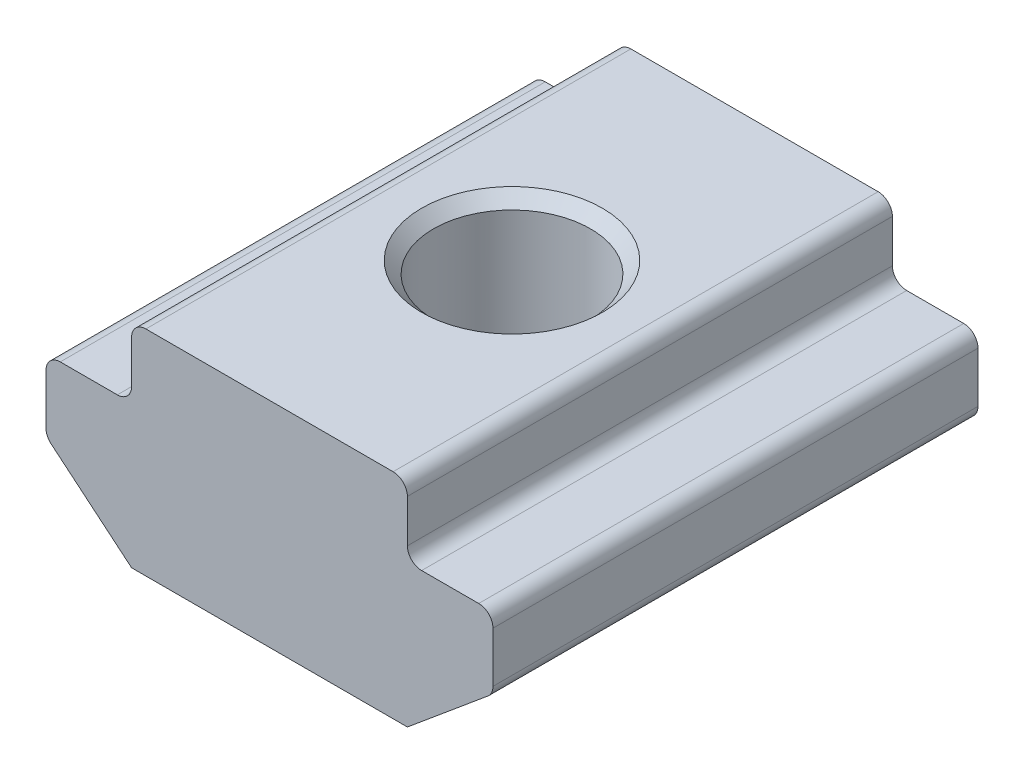
ISO-10303-21;
HEADER;
FILE_DESCRIPTION(('STEP AP214'),'2;1');
FILE_NAME('part.step','',(''),(''),'','','');
FILE_SCHEMA(('AUTOMOTIVE_DESIGN { 1 0 10303 214 1 1 1 1 }'));
ENDSEC;
DATA;
#1=APPLICATION_CONTEXT('core data for automotive mechanical design processes');
#2=APPLICATION_PROTOCOL_DEFINITION('international standard','automotive_design',2000,#1);
#3=PRODUCT_CONTEXT('',#1,'mechanical');
#4=PRODUCT('Part','Part','',(#3));
#5=PRODUCT_RELATED_PRODUCT_CATEGORY('part','',(#4));
#6=PRODUCT_DEFINITION_FORMATION('','',#4);
#7=PRODUCT_DEFINITION_CONTEXT('part definition',#1,'design');
#8=PRODUCT_DEFINITION('design','',#6,#7);
#9=PRODUCT_DEFINITION_SHAPE('','',#8);
#10=(LENGTH_UNIT() NAMED_UNIT(*) SI_UNIT(.MILLI.,.METRE.));
#11=(NAMED_UNIT(*) PLANE_ANGLE_UNIT() SI_UNIT($,.RADIAN.));
#12=(NAMED_UNIT(*) SI_UNIT($,.STERADIAN.) SOLID_ANGLE_UNIT());
#13=UNCERTAINTY_MEASURE_WITH_UNIT(LENGTH_MEASURE(1.E-05),#10,'distance_accuracy_value','');
#14=(GEOMETRIC_REPRESENTATION_CONTEXT(3) GLOBAL_UNCERTAINTY_ASSIGNED_CONTEXT((#13)) GLOBAL_UNIT_ASSIGNED_CONTEXT((#10,
#11,#12)) REPRESENTATION_CONTEXT('',''));
#15=CARTESIAN_POINT('',(0.,0.,0.));
#16=DIRECTION('',(0.,0.,1.));
#17=DIRECTION('',(1.,0.,0.));
#18=AXIS2_PLACEMENT_3D('',#15,#16,#17);
#19=CARTESIAN_POINT('',(-4.23071129317841,3.02470932674123,4.15637164033578));
#20=DIRECTION('',(1.,0.,0.));
#21=DIRECTION('',(0.,0.,-1.));
#22=AXIS2_PLACEMENT_3D('',#19,#20,#21);
#23=PLANE('',#22);
#24=DIRECTION('',(0.,-1.,0.));
#25=VECTOR('',#24,1.);
#26=CARTESIAN_POINT('',(-4.23071129317841,3.02470932674123,4.15637164033578));
#27=LINE('',#26,#25);
#28=CARTESIAN_POINT('',(-4.23071129317841,4.22470932674123,4.15637164033578));
#29=VERTEX_POINT('',#28);
#30=CARTESIAN_POINT('',(-4.23071129317841,3.32470932674123,4.15637164033578));
#31=VERTEX_POINT('',#30);
#32=EDGE_CURVE('E211',#29,#31,#27,.T.);
#33=ORIENTED_EDGE('',*,*,#32,.F.);
#34=DIRECTION('',(0.,0.,-1.));
#35=VECTOR('',#34,1.);
#36=CARTESIAN_POINT('',(-4.23071129317841,4.22470932674123,4.15637164033578));
#37=LINE('',#36,#35);
#38=CARTESIAN_POINT('',(-4.23071129317841,4.22470932674123,-6.04362835966422));
#39=VERTEX_POINT('',#38);
#40=EDGE_CURVE('E251',#29,#39,#37,.T.);
#41=ORIENTED_EDGE('',*,*,#40,.T.);
#42=DIRECTION('',(0.,-1.,0.));
#43=VECTOR('',#42,1.);
#44=CARTESIAN_POINT('',(-4.23071129317841,3.02470932674123,-6.04362835966422));
#45=LINE('',#44,#43);
#46=CARTESIAN_POINT('',(-4.23071129317841,3.32470932674123,-6.04362835966422));
#47=VERTEX_POINT('',#46);
#48=EDGE_CURVE('E184',#39,#47,#45,.T.);
#49=ORIENTED_EDGE('',*,*,#48,.T.);
#50=DIRECTION('',(0.,0.,-1.));
#51=VECTOR('',#50,1.);
#52=CARTESIAN_POINT('',(-4.23071129317841,3.32470932674123,4.15637164033578));
#53=LINE('',#52,#51);
#54=EDGE_CURVE('E249',#47,#31,#53,.F.);
#55=ORIENTED_EDGE('',*,*,#54,.T.);
#56=EDGE_LOOP('',(#33,#41,#49,#55));
#57=FACE_BOUND('',#56,.T.);
#58=ADVANCED_FACE('F16',(#57),#23,.F.);
#59=CARTESIAN_POINT('',(-6.03071129317841,3.02470932674123,4.15637164033578));
#60=DIRECTION('',(0.,-1.,0.));
#61=DIRECTION('',(0.,0.,-1.));
#62=AXIS2_PLACEMENT_3D('',#59,#60,#61);
#63=PLANE('',#62);
#64=DIRECTION('',(-1.,0.,0.));
#65=VECTOR('',#64,1.);
#66=CARTESIAN_POINT('',(-6.03071129317841,3.02470932674123,4.15637164033578));
#67=LINE('',#66,#65);
#68=CARTESIAN_POINT('',(-4.53071129317841,3.02470932674123,4.15637164033578));
#69=VERTEX_POINT('',#68);
#70=CARTESIAN_POINT('',(-5.73071129317841,3.02470932674123,4.15637164033578));
#71=VERTEX_POINT('',#70);
#72=EDGE_CURVE('E375',#69,#71,#67,.T.);
#73=ORIENTED_EDGE('',*,*,#72,.F.);
#74=DIRECTION('',(0.,0.,-1.));
#75=VECTOR('',#74,1.);
#76=CARTESIAN_POINT('',(-4.53071129317841,3.02470932674123,-6.04362835966422));
#77=LINE('',#76,#75);
#78=CARTESIAN_POINT('',(-4.53071129317841,3.02470932674123,-6.04362835966422));
#79=VERTEX_POINT('',#78);
#80=EDGE_CURVE('E256',#69,#79,#77,.T.);
#81=ORIENTED_EDGE('',*,*,#80,.T.);
#82=DIRECTION('',(-1.,0.,0.));
#83=VECTOR('',#82,1.);
#84=CARTESIAN_POINT('',(-6.03071129317841,3.02470932674123,-6.04362835966422));
#85=LINE('',#84,#83);
#86=CARTESIAN_POINT('',(-5.73071129317841,3.02470932674123,-6.04362835966422));
#87=VERTEX_POINT('',#86);
#88=EDGE_CURVE('E187',#79,#87,#85,.T.);
#89=ORIENTED_EDGE('',*,*,#88,.T.);
#90=DIRECTION('',(0.,0.,-1.));
#91=VECTOR('',#90,1.);
#92=CARTESIAN_POINT('',(-5.73071129317841,3.02470932674123,4.15637164033578));
#93=LINE('',#92,#91);
#94=EDGE_CURVE('E254',#87,#71,#93,.F.);
#95=ORIENTED_EDGE('',*,*,#94,.T.);
#96=EDGE_LOOP('',(#73,#81,#89,#95));
#97=FACE_BOUND('',#96,.T.);
#98=ADVANCED_FACE('F296',(#97),#63,.F.);
#99=CARTESIAN_POINT('',(-6.03071129317841,3.02470932674123,4.15637164033578));
#100=DIRECTION('',(1.,0.,0.));
#101=DIRECTION('',(0.,1.,0.));
#102=AXIS2_PLACEMENT_3D('',#99,#100,#101);
#103=PLANE('',#102);
#104=DIRECTION('',(0.,-1.,0.));
#105=VECTOR('',#104,1.);
#106=CARTESIAN_POINT('',(-6.03071129317841,3.02470932674123,-6.04362835966422));
#107=LINE('',#106,#105);
#108=CARTESIAN_POINT('',(-6.03071129317841,2.72470932674123,-6.04362835966422));
#109=VERTEX_POINT('',#108);
#110=CARTESIAN_POINT('',(-6.03071129317841,1.66522181053656,-6.04362835966422));
#111=VERTEX_POINT('',#110);
#112=EDGE_CURVE('E191',#109,#111,#107,.T.);
#113=ORIENTED_EDGE('',*,*,#112,.T.);
#114=DIRECTION('',(0.,0.,-1.));
#115=VECTOR('',#114,1.);
#116=CARTESIAN_POINT('',(-6.03071129317841,1.66522181053656,4.15637164033578));
#117=LINE('',#116,#115);
#118=CARTESIAN_POINT('',(-6.03071129317841,1.66522181053656,4.15637164033578));
#119=VERTEX_POINT('',#118);
#120=EDGE_CURVE('E264',#111,#119,#117,.F.);
#121=ORIENTED_EDGE('',*,*,#120,.T.);
#122=DIRECTION('',(0.,-1.,0.));
#123=VECTOR('',#122,1.);
#124=CARTESIAN_POINT('',(-6.03071129317841,3.02470932674123,4.15637164033578));
#125=LINE('',#124,#123);
#126=CARTESIAN_POINT('',(-6.03071129317841,2.72470932674123,4.15637164033578));
#127=VERTEX_POINT('',#126);
#128=EDGE_CURVE('E154',#127,#119,#125,.T.);
#129=ORIENTED_EDGE('',*,*,#128,.F.);
#130=DIRECTION('',(0.,0.,-1.));
#131=VECTOR('',#130,1.);
#132=CARTESIAN_POINT('',(-6.03071129317841,2.72470932674123,4.15637164033578));
#133=LINE('',#132,#131);
#134=EDGE_CURVE('E261',#127,#109,#133,.T.);
#135=ORIENTED_EDGE('',*,*,#134,.T.);
#136=EDGE_LOOP('',(#113,#121,#129,#135));
#137=FACE_BOUND('',#136,.T.);
#138=ADVANCED_FACE('F302',(#137),#103,.F.);
#139=CARTESIAN_POINT('',(-6.03071129317841,1.52470932674123,4.15637164033578));
#140=DIRECTION('',(0.64018439966448,0.768221279597376,0.));
#141=DIRECTION('',(-0.768221279597376,0.64018439966448,0.));
#142=AXIS2_PLACEMENT_3D('',#139,#140,#141);
#143=PLANE('',#142);
#144=DIRECTION('',(0.768221279597376,-0.64018439966448,0.));
#145=VECTOR('',#144,1.);
#146=CARTESIAN_POINT('',(-6.03071129317841,1.52470932674123,4.15637164033578));
#147=LINE('',#146,#145);
#148=CARTESIAN_POINT('',(-5.92276661307775,1.43475542665735,4.15637164033578));
#149=VERTEX_POINT('',#148);
#150=CARTESIAN_POINT('',(-4.23071129317841,0.0247093267412312,4.15637164033578));
#151=VERTEX_POINT('',#150);
#152=EDGE_CURVE('E141',#149,#151,#147,.T.);
#153=ORIENTED_EDGE('',*,*,#152,.F.);
#154=DIRECTION('',(0.,0.,-1.));
#155=VECTOR('',#154,1.);
#156=CARTESIAN_POINT('',(-5.92276661307775,1.43475542665735,4.15637164033578));
#157=LINE('',#156,#155);
#158=CARTESIAN_POINT('',(-5.92276661307775,1.43475542665735,-6.04362835966422));
#159=VERTEX_POINT('',#158);
#160=EDGE_CURVE('E259',#149,#159,#157,.T.);
#161=ORIENTED_EDGE('',*,*,#160,.T.);
#162=DIRECTION('',(0.768221279597376,-0.64018439966448,0.));
#163=VECTOR('',#162,1.);
#164=CARTESIAN_POINT('',(-6.03071129317841,1.52470932674123,-6.04362835966422));
#165=LINE('',#164,#163);
#166=CARTESIAN_POINT('',(-4.23071129317841,0.0247093267412312,-6.04362835966422));
#167=VERTEX_POINT('',#166);
#168=EDGE_CURVE('E160',#159,#167,#165,.T.);
#169=ORIENTED_EDGE('',*,*,#168,.T.);
#170=DIRECTION('',(0.,0.,-1.));
#171=VECTOR('',#170,1.);
#172=CARTESIAN_POINT('',(-4.23071129317841,0.0247093267412312,4.15637164033578));
#173=LINE('',#172,#171);
#174=EDGE_CURVE('E157',#151,#167,#173,.T.);
#175=ORIENTED_EDGE('',*,*,#174,.F.);
#176=EDGE_LOOP('',(#153,#161,#169,#175));
#177=FACE_BOUND('',#176,.T.);
#178=ADVANCED_FACE('F158',(#177),#143,.F.);
#179=CARTESIAN_POINT('',(1.56928870682159,0.0247093267412321,4.15637164033578));
#180=DIRECTION('',(0.,1.,0.));
#181=DIRECTION('',(-1.,0.,0.));
#182=AXIS2_PLACEMENT_3D('',#179,#180,#181);
#183=PLANE('',#182);
#184=CARTESIAN_POINT('',(-1.33071129317841,0.0247093267412308,-0.943628359664217));
#185=DIRECTION('',(0.,1.,0.));
#186=DIRECTION('',(-1.,0.,0.));
#187=AXIS2_PLACEMENT_3D('',#184,#185,#186);
#188=CIRCLE('',#187,1.65);
#189=CARTESIAN_POINT('',(-2.98071129317841,0.0247093267412309,-0.943628359664217));
#190=VERTEX_POINT('',#189);
#191=EDGE_CURVE('E188',#190,#190,#188,.T.);
#192=ORIENTED_EDGE('',*,*,#191,.T.);
#193=EDGE_LOOP('',(#192));
#194=FACE_BOUND('',#193,.T.);
#195=DIRECTION('',(1.,0.,0.));
#196=VECTOR('',#195,1.);
#197=CARTESIAN_POINT('',(1.56928870682159,0.0247093267412321,-6.04362835966422));
#198=LINE('',#197,#196);
#199=CARTESIAN_POINT('',(1.56928870682159,0.0247093267412321,-6.04362835966422));
#200=VERTEX_POINT('',#199);
#201=EDGE_CURVE('E195',#167,#200,#198,.T.);
#202=ORIENTED_EDGE('',*,*,#201,.T.);
#203=DIRECTION('',(0.,0.,-1.));
#204=VECTOR('',#203,1.);
#205=CARTESIAN_POINT('',(1.56928870682159,0.0247093267412321,4.15637164033578));
#206=LINE('',#205,#204);
#207=CARTESIAN_POINT('',(1.56928870682159,0.0247093267412321,4.15637164033578));
#208=VERTEX_POINT('',#207);
#209=EDGE_CURVE('E164',#208,#200,#206,.T.);
#210=ORIENTED_EDGE('',*,*,#209,.F.);
#211=DIRECTION('',(1.,0.,0.));
#212=VECTOR('',#211,1.);
#213=CARTESIAN_POINT('',(1.56928870682159,0.0247093267412321,4.15637164033578));
#214=LINE('',#213,#212);
#215=EDGE_CURVE('E146',#151,#208,#214,.T.);
#216=ORIENTED_EDGE('',*,*,#215,.F.);
#217=ORIENTED_EDGE('',*,*,#174,.T.);
#218=EDGE_LOOP('',(#202,#210,#216,#217));
#219=FACE_BOUND('',#218,.T.);
#220=ADVANCED_FACE('F166',(#194,#219),#183,.F.);
#221=CARTESIAN_POINT('',(3.36928870682159,1.52470932674123,4.15637164033578));
#222=DIRECTION('',(-0.64018439966448,0.768221279597376,0.));
#223=DIRECTION('',(-0.768221279597376,-0.64018439966448,0.));
#224=AXIS2_PLACEMENT_3D('',#221,#222,#223);
#225=PLANE('',#224);
#226=DIRECTION('',(0.768221279597376,0.64018439966448,0.));
#227=VECTOR('',#226,1.);
#228=CARTESIAN_POINT('',(3.36928870682159,1.52470932674123,-6.04362835966422));
#229=LINE('',#228,#227);
#230=CARTESIAN_POINT('',(3.26134402672093,1.43475542665735,-6.04362835966422));
#231=VERTEX_POINT('',#230);
#232=EDGE_CURVE('E197',#200,#231,#229,.T.);
#233=ORIENTED_EDGE('',*,*,#232,.T.);
#234=DIRECTION('',(0.,0.,-1.));
#235=VECTOR('',#234,1.);
#236=CARTESIAN_POINT('',(3.26134402672093,1.43475542665735,4.15637164033578));
#237=LINE('',#236,#235);
#238=CARTESIAN_POINT('',(3.26134402672093,1.43475542665735,4.15637164033578));
#239=VERTEX_POINT('',#238);
#240=EDGE_CURVE('E270',#231,#239,#237,.F.);
#241=ORIENTED_EDGE('',*,*,#240,.T.);
#242=DIRECTION('',(0.768221279597376,0.64018439966448,0.));
#243=VECTOR('',#242,1.);
#244=CARTESIAN_POINT('',(3.36928870682159,1.52470932674123,4.15637164033578));
#245=LINE('',#244,#243);
#246=EDGE_CURVE('E169',#208,#239,#245,.T.);
#247=ORIENTED_EDGE('',*,*,#246,.F.);
#248=ORIENTED_EDGE('',*,*,#209,.T.);
#249=EDGE_LOOP('',(#233,#241,#247,#248));
#250=FACE_BOUND('',#249,.T.);
#251=ADVANCED_FACE('F401',(#250),#225,.F.);
#252=CARTESIAN_POINT('',(3.36928870682159,3.02470932674123,4.15637164033578));
#253=DIRECTION('',(-1.,0.,0.));
#254=DIRECTION('',(0.,0.,1.));
#255=AXIS2_PLACEMENT_3D('',#252,#253,#254);
#256=PLANE('',#255);
#257=DIRECTION('',(0.,1.,0.));
#258=VECTOR('',#257,1.);
#259=CARTESIAN_POINT('',(3.36928870682159,3.02470932674123,4.15637164033578));
#260=LINE('',#259,#258);
#261=CARTESIAN_POINT('',(3.36928870682159,1.66522181053656,4.15637164033578));
#262=VERTEX_POINT('',#261);
#263=CARTESIAN_POINT('',(3.36928870682159,2.72470932674123,4.15637164033578));
#264=VERTEX_POINT('',#263);
#265=EDGE_CURVE('E171',#262,#264,#260,.T.);
#266=ORIENTED_EDGE('',*,*,#265,.F.);
#267=DIRECTION('',(0.,0.,-1.));
#268=VECTOR('',#267,1.);
#269=CARTESIAN_POINT('',(3.36928870682159,1.66522181053656,4.15637164033578));
#270=LINE('',#269,#268);
#271=CARTESIAN_POINT('',(3.36928870682159,1.66522181053656,-6.04362835966422));
#272=VERTEX_POINT('',#271);
#273=EDGE_CURVE('E267',#262,#272,#270,.T.);
#274=ORIENTED_EDGE('',*,*,#273,.T.);
#275=DIRECTION('',(0.,1.,0.));
#276=VECTOR('',#275,1.);
#277=CARTESIAN_POINT('',(3.36928870682159,3.02470932674123,-6.04362835966422));
#278=LINE('',#277,#276);
#279=CARTESIAN_POINT('',(3.36928870682159,2.72470932674123,-6.04362835966422));
#280=VERTEX_POINT('',#279);
#281=EDGE_CURVE('E200',#272,#280,#278,.T.);
#282=ORIENTED_EDGE('',*,*,#281,.T.);
#283=DIRECTION('',(0.,0.,-1.));
#284=VECTOR('',#283,1.);
#285=CARTESIAN_POINT('',(3.36928870682159,2.72470932674123,4.15637164033578));
#286=LINE('',#285,#284);
#287=EDGE_CURVE('E31',#280,#264,#286,.F.);
#288=ORIENTED_EDGE('',*,*,#287,.T.);
#289=EDGE_LOOP('',(#266,#274,#282,#288));
#290=FACE_BOUND('',#289,.T.);
#291=ADVANCED_FACE('F339',(#290),#256,.F.);
#292=CARTESIAN_POINT('',(1.56928870682159,3.02470932674123,4.15637164033578));
#293=DIRECTION('',(0.,-1.,0.));
#294=DIRECTION('',(0.,0.,-1.));
#295=AXIS2_PLACEMENT_3D('',#292,#293,#294);
#296=PLANE('',#295);
#297=DIRECTION('',(-1.,0.,0.));
#298=VECTOR('',#297,1.);
#299=CARTESIAN_POINT('',(1.56928870682159,3.02470932674123,-6.04362835966422));
#300=LINE('',#299,#298);
#301=CARTESIAN_POINT('',(3.06928870682159,3.02470932674123,-6.04362835966422));
#302=VERTEX_POINT('',#301);
#303=CARTESIAN_POINT('',(1.86928870682159,3.02470932674123,-6.04362835966422));
#304=VERTEX_POINT('',#303);
#305=EDGE_CURVE('E202',#302,#304,#300,.T.);
#306=ORIENTED_EDGE('',*,*,#305,.T.);
#307=DIRECTION('',(0.,0.,-1.));
#308=VECTOR('',#307,1.);
#309=CARTESIAN_POINT('',(1.86928870682159,3.02470932674123,4.15637164033578));
#310=LINE('',#309,#308);
#311=CARTESIAN_POINT('',(1.86928870682159,3.02470932674123,4.15637164033578));
#312=VERTEX_POINT('',#311);
#313=EDGE_CURVE('E220',#304,#312,#310,.F.);
#314=ORIENTED_EDGE('',*,*,#313,.T.);
#315=DIRECTION('',(-1.,0.,0.));
#316=VECTOR('',#315,1.);
#317=CARTESIAN_POINT('',(1.56928870682159,3.02470932674123,4.15637164033578));
#318=LINE('',#317,#316);
#319=CARTESIAN_POINT('',(3.06928870682159,3.02470932674123,4.15637164033578));
#320=VERTEX_POINT('',#319);
#321=EDGE_CURVE('E176',#320,#312,#318,.T.);
#322=ORIENTED_EDGE('',*,*,#321,.F.);
#323=DIRECTION('',(0.,0.,-1.));
#324=VECTOR('',#323,1.);
#325=CARTESIAN_POINT('',(3.06928870682159,3.02470932674123,4.15637164033578));
#326=LINE('',#325,#324);
#327=EDGE_CURVE('E217',#320,#302,#326,.T.);
#328=ORIENTED_EDGE('',*,*,#327,.T.);
#329=EDGE_LOOP('',(#306,#314,#322,#328));
#330=FACE_BOUND('',#329,.T.);
#331=ADVANCED_FACE('F349',(#330),#296,.F.);
#332=CARTESIAN_POINT('',(1.56928870682159,4.52470932674123,4.15637164033578));
#333=DIRECTION('',(-1.,0.,0.));
#334=DIRECTION('',(0.,-1.,0.));
#335=AXIS2_PLACEMENT_3D('',#332,#333,#334);
#336=PLANE('',#335);
#337=DIRECTION('',(0.,1.,0.));
#338=VECTOR('',#337,1.);
#339=CARTESIAN_POINT('',(1.56928870682159,4.52470932674123,4.15637164033578));
#340=LINE('',#339,#338);
#341=CARTESIAN_POINT('',(1.56928870682159,3.32470932674123,4.15637164033578));
#342=VERTEX_POINT('',#341);
#343=CARTESIAN_POINT('',(1.56928870682159,4.22470932674123,4.15637164033578));
#344=VERTEX_POINT('',#343);
#345=EDGE_CURVE('E179',#342,#344,#340,.T.);
#346=ORIENTED_EDGE('',*,*,#345,.F.);
#347=DIRECTION('',(0.,0.,-1.));
#348=VECTOR('',#347,1.);
#349=CARTESIAN_POINT('',(1.56928870682159,3.32470932674123,-6.04362835966422));
#350=LINE('',#349,#348);
#351=CARTESIAN_POINT('',(1.56928870682159,3.32470932674123,-6.04362835966422));
#352=VERTEX_POINT('',#351);
#353=EDGE_CURVE('E214',#342,#352,#350,.T.);
#354=ORIENTED_EDGE('',*,*,#353,.T.);
#355=DIRECTION('',(0.,1.,0.));
#356=VECTOR('',#355,1.);
#357=CARTESIAN_POINT('',(1.56928870682159,4.52470932674123,-6.04362835966422));
#358=LINE('',#357,#356);
#359=CARTESIAN_POINT('',(1.56928870682159,4.22470932674123,-6.04362835966422));
#360=VERTEX_POINT('',#359);
#361=EDGE_CURVE('E205',#352,#360,#358,.T.);
#362=ORIENTED_EDGE('',*,*,#361,.T.);
#363=DIRECTION('',(0.,0.,-1.));
#364=VECTOR('',#363,1.);
#365=CARTESIAN_POINT('',(1.56928870682159,4.22470932674123,4.15637164033578));
#366=LINE('',#365,#364);
#367=EDGE_CURVE('E163',#360,#344,#366,.F.);
#368=ORIENTED_EDGE('',*,*,#367,.T.);
#369=EDGE_LOOP('',(#346,#354,#362,#368));
#370=FACE_BOUND('',#369,.T.);
#371=ADVANCED_FACE('F356',(#370),#336,.F.);
#372=CARTESIAN_POINT('',(-4.23071129317841,4.52470932674123,4.15637164033578));
#373=DIRECTION('',(0.,-1.,0.));
#374=DIRECTION('',(0.,0.,-1.));
#375=AXIS2_PLACEMENT_3D('',#372,#373,#374);
#376=PLANE('',#375);
#377=CARTESIAN_POINT('',(-1.33071129317841,4.52470932674123,-0.943628359664217));
#378=DIRECTION('',(0.,-1.,0.));
#379=DIRECTION('',(0.,0.,-1.));
#380=AXIS2_PLACEMENT_3D('',#377,#378,#379);
#381=CIRCLE('',#380,1.9);
#382=CARTESIAN_POINT('',(-1.33071129317841,4.52470932674123,-2.84362835966422));
#383=VERTEX_POINT('',#382);
#384=EDGE_CURVE('E10',#383,#383,#381,.T.);
#385=ORIENTED_EDGE('',*,*,#384,.T.);
#386=EDGE_LOOP('',(#385));
#387=FACE_BOUND('',#386,.T.);
#388=DIRECTION('',(-1.,0.,0.));
#389=VECTOR('',#388,1.);
#390=CARTESIAN_POINT('',(-4.23071129317841,4.52470932674123,4.15637164033578));
#391=LINE('',#390,#389);
#392=CARTESIAN_POINT('',(1.26928870682159,4.52470932674123,4.15637164033578));
#393=VERTEX_POINT('',#392);
#394=CARTESIAN_POINT('',(-3.93071129317841,4.52470932674123,4.15637164033578));
#395=VERTEX_POINT('',#394);
#396=EDGE_CURVE('E181',#393,#395,#391,.T.);
#397=ORIENTED_EDGE('',*,*,#396,.F.);
#398=DIRECTION('',(0.,0.,-1.));
#399=VECTOR('',#398,1.);
#400=CARTESIAN_POINT('',(1.26928870682159,4.52470932674123,4.15637164033578));
#401=LINE('',#400,#399);
#402=CARTESIAN_POINT('',(1.26928870682159,4.52470932674123,-6.04362835966422));
#403=VERTEX_POINT('',#402);
#404=EDGE_CURVE('E224',#393,#403,#401,.T.);
#405=ORIENTED_EDGE('',*,*,#404,.T.);
#406=DIRECTION('',(-1.,0.,0.));
#407=VECTOR('',#406,1.);
#408=CARTESIAN_POINT('',(-4.23071129317841,4.52470932674123,-6.04362835966422));
#409=LINE('',#408,#407);
#410=CARTESIAN_POINT('',(-3.93071129317841,4.52470932674123,-6.04362835966422));
#411=VERTEX_POINT('',#410);
#412=EDGE_CURVE('E208',#403,#411,#409,.T.);
#413=ORIENTED_EDGE('',*,*,#412,.T.);
#414=DIRECTION('',(0.,0.,-1.));
#415=VECTOR('',#414,1.);
#416=CARTESIAN_POINT('',(-3.93071129317841,4.52470932674123,4.15637164033578));
#417=LINE('',#416,#415);
#418=EDGE_CURVE('E222',#411,#395,#417,.F.);
#419=ORIENTED_EDGE('',*,*,#418,.T.);
#420=EDGE_LOOP('',(#397,#405,#413,#419));
#421=FACE_BOUND('',#420,.T.);
#422=ADVANCED_FACE('F362',(#387,#421),#376,.F.);
#423=CARTESIAN_POINT('',(-1.33071129317841,2.27470932674123,4.15637164033578));
#424=DIRECTION('',(0.,0.,-1.));
#425=DIRECTION('',(-1.,0.,0.));
#426=AXIS2_PLACEMENT_3D('',#423,#424,#425);
#427=PLANE('',#426);
#428=ORIENTED_EDGE('',*,*,#345,.T.);
#429=CARTESIAN_POINT('',(1.26928870682159,4.22470932674123,4.15637164033578));
#430=DIRECTION('',(0.,0.,-1.));
#431=DIRECTION('',(-1.,0.,0.));
#432=AXIS2_PLACEMENT_3D('',#429,#430,#431);
#433=CIRCLE('',#432,0.3);
#434=EDGE_CURVE('E247',#344,#393,#433,.F.);
#435=ORIENTED_EDGE('',*,*,#434,.T.);
#436=ORIENTED_EDGE('',*,*,#396,.T.);
#437=CARTESIAN_POINT('',(-3.93071129317841,4.22470932674123,4.15637164033578));
#438=DIRECTION('',(0.,0.,-1.));
#439=DIRECTION('',(-1.,0.,0.));
#440=AXIS2_PLACEMENT_3D('',#437,#438,#439);
#441=CIRCLE('',#440,0.3);
#442=EDGE_CURVE('E245',#395,#29,#441,.F.);
#443=ORIENTED_EDGE('',*,*,#442,.T.);
#444=ORIENTED_EDGE('',*,*,#32,.T.);
#445=CARTESIAN_POINT('',(-4.53071129317841,3.32470932674123,4.15637164033578));
#446=DIRECTION('',(0.,0.,-1.));
#447=DIRECTION('',(-1.,0.,0.));
#448=AXIS2_PLACEMENT_3D('',#445,#446,#447);
#449=CIRCLE('',#448,0.3);
#450=EDGE_CURVE('E278',#31,#69,#449,.T.);
#451=ORIENTED_EDGE('',*,*,#450,.T.);
#452=ORIENTED_EDGE('',*,*,#72,.T.);
#453=CARTESIAN_POINT('',(-5.73071129317841,2.72470932674123,4.15637164033578));
#454=DIRECTION('',(0.,0.,-1.));
#455=DIRECTION('',(-1.,0.,0.));
#456=AXIS2_PLACEMENT_3D('',#453,#454,#455);
#457=CIRCLE('',#456,0.3);
#458=EDGE_CURVE('E242',#71,#127,#457,.F.);
#459=ORIENTED_EDGE('',*,*,#458,.T.);
#460=ORIENTED_EDGE('',*,*,#128,.T.);
#461=CARTESIAN_POINT('',(-5.73071129317841,1.66522181053656,4.15637164033578));
#462=DIRECTION('',(0.,0.,-1.));
#463=DIRECTION('',(-1.,0.,0.));
#464=AXIS2_PLACEMENT_3D('',#461,#462,#463);
#465=CIRCLE('',#464,0.3);
#466=EDGE_CURVE('E150',#119,#149,#465,.F.);
#467=ORIENTED_EDGE('',*,*,#466,.T.);
#468=ORIENTED_EDGE('',*,*,#152,.T.);
#469=ORIENTED_EDGE('',*,*,#215,.T.);
#470=ORIENTED_EDGE('',*,*,#246,.T.);
#471=CARTESIAN_POINT('',(3.06928870682159,1.66522181053656,4.15637164033578));
#472=DIRECTION('',(0.,0.,-1.));
#473=DIRECTION('',(-1.,0.,0.));
#474=AXIS2_PLACEMENT_3D('',#471,#472,#473);
#475=CIRCLE('',#474,0.3);
#476=EDGE_CURVE('E38',#239,#262,#475,.F.);
#477=ORIENTED_EDGE('',*,*,#476,.T.);
#478=ORIENTED_EDGE('',*,*,#265,.T.);
#479=CARTESIAN_POINT('',(3.06928870682159,2.72470932674123,4.15637164033578));
#480=DIRECTION('',(0.,0.,-1.));
#481=DIRECTION('',(-1.,0.,0.));
#482=AXIS2_PLACEMENT_3D('',#479,#480,#481);
#483=CIRCLE('',#482,0.3);
#484=EDGE_CURVE('E239',#264,#320,#483,.F.);
#485=ORIENTED_EDGE('',*,*,#484,.T.);
#486=ORIENTED_EDGE('',*,*,#321,.T.);
#487=CARTESIAN_POINT('',(1.86928870682159,3.32470932674123,4.15637164033578));
#488=DIRECTION('',(0.,0.,-1.));
#489=DIRECTION('',(-1.,0.,0.));
#490=AXIS2_PLACEMENT_3D('',#487,#488,#489);
#491=CIRCLE('',#490,0.3);
#492=EDGE_CURVE('E274',#312,#342,#491,.T.);
#493=ORIENTED_EDGE('',*,*,#492,.T.);
#494=EDGE_LOOP('',(#428,#435,#436,#443,#444,#451,#452,#459,#460,#467,#468,#469,#470,#477,#478,
#485,#486,#493));
#495=FACE_BOUND('',#494,.T.);
#496=ADVANCED_FACE('F144',(#495),#427,.F.);
#497=CARTESIAN_POINT('',(-1.33071129317841,2.27470932674123,-6.04362835966422));
#498=DIRECTION('',(0.,0.,-1.));
#499=DIRECTION('',(-1.,0.,0.));
#500=AXIS2_PLACEMENT_3D('',#497,#498,#499);
#501=PLANE('',#500);
#502=ORIENTED_EDGE('',*,*,#412,.F.);
#503=CARTESIAN_POINT('',(1.26928870682159,4.22470932674123,-6.04362835966422));
#504=DIRECTION('',(0.,0.,-1.));
#505=DIRECTION('',(-1.,0.,0.));
#506=AXIS2_PLACEMENT_3D('',#503,#504,#505);
#507=CIRCLE('',#506,0.3);
#508=EDGE_CURVE('E237',#403,#360,#507,.T.);
#509=ORIENTED_EDGE('',*,*,#508,.T.);
#510=ORIENTED_EDGE('',*,*,#361,.F.);
#511=CARTESIAN_POINT('',(1.86928870682159,3.32470932674123,-6.04362835966422));
#512=DIRECTION('',(0.,0.,-1.));
#513=DIRECTION('',(-1.,0.,0.));
#514=AXIS2_PLACEMENT_3D('',#511,#512,#513);
#515=CIRCLE('',#514,0.3);
#516=EDGE_CURVE('E272',#352,#304,#515,.F.);
#517=ORIENTED_EDGE('',*,*,#516,.T.);
#518=ORIENTED_EDGE('',*,*,#305,.F.);
#519=CARTESIAN_POINT('',(3.06928870682159,2.72470932674123,-6.04362835966422));
#520=DIRECTION('',(0.,0.,-1.));
#521=DIRECTION('',(-1.,0.,0.));
#522=AXIS2_PLACEMENT_3D('',#519,#520,#521);
#523=CIRCLE('',#522,0.3);
#524=EDGE_CURVE('E227',#302,#280,#523,.T.);
#525=ORIENTED_EDGE('',*,*,#524,.T.);
#526=ORIENTED_EDGE('',*,*,#281,.F.);
#527=CARTESIAN_POINT('',(3.06928870682159,1.66522181053656,-6.04362835966422));
#528=DIRECTION('',(0.,0.,-1.));
#529=DIRECTION('',(-1.,0.,0.));
#530=AXIS2_PLACEMENT_3D('',#527,#528,#529);
#531=CIRCLE('',#530,0.3);
#532=EDGE_CURVE('E229',#272,#231,#531,.T.);
#533=ORIENTED_EDGE('',*,*,#532,.T.);
#534=ORIENTED_EDGE('',*,*,#232,.F.);
#535=ORIENTED_EDGE('',*,*,#201,.F.);
#536=ORIENTED_EDGE('',*,*,#168,.F.);
#537=CARTESIAN_POINT('',(-5.73071129317841,1.66522181053656,-6.04362835966422));
#538=DIRECTION('',(0.,0.,-1.));
#539=DIRECTION('',(-1.,0.,0.));
#540=AXIS2_PLACEMENT_3D('',#537,#538,#539);
#541=CIRCLE('',#540,0.3);
#542=EDGE_CURVE('E233',#159,#111,#541,.T.);
#543=ORIENTED_EDGE('',*,*,#542,.T.);
#544=ORIENTED_EDGE('',*,*,#112,.F.);
#545=CARTESIAN_POINT('',(-5.73071129317841,2.72470932674123,-6.04362835966422));
#546=DIRECTION('',(0.,0.,-1.));
#547=DIRECTION('',(-1.,0.,0.));
#548=AXIS2_PLACEMENT_3D('',#545,#546,#547);
#549=CIRCLE('',#548,0.3);
#550=EDGE_CURVE('E231',#109,#87,#549,.T.);
#551=ORIENTED_EDGE('',*,*,#550,.T.);
#552=ORIENTED_EDGE('',*,*,#88,.F.);
#553=CARTESIAN_POINT('',(-4.53071129317841,3.32470932674123,-6.04362835966422));
#554=DIRECTION('',(0.,0.,-1.));
#555=DIRECTION('',(-1.,0.,0.));
#556=AXIS2_PLACEMENT_3D('',#553,#554,#555);
#557=CIRCLE('',#556,0.3);
#558=EDGE_CURVE('E276',#79,#47,#557,.F.);
#559=ORIENTED_EDGE('',*,*,#558,.T.);
#560=ORIENTED_EDGE('',*,*,#48,.F.);
#561=CARTESIAN_POINT('',(-3.93071129317841,4.22470932674123,-6.04362835966422));
#562=DIRECTION('',(0.,0.,-1.));
#563=DIRECTION('',(-1.,0.,0.));
#564=AXIS2_PLACEMENT_3D('',#561,#562,#563);
#565=CIRCLE('',#564,0.3);
#566=EDGE_CURVE('E235',#39,#411,#565,.T.);
#567=ORIENTED_EDGE('',*,*,#566,.T.);
#568=EDGE_LOOP('',(#502,#509,#510,#517,#518,#525,#526,#533,#534,#535,#536,#543,#544,#551,#552,
#559,#560,#567));
#569=FACE_BOUND('',#568,.T.);
#570=ADVANCED_FACE('F342',(#569),#501,.T.);
#571=CARTESIAN_POINT('',(-1.33071129317841,0.0247093267412308,-0.943628359664217));
#572=DIRECTION('',(0.,1.,0.));
#573=DIRECTION('',(-1.,0.,0.));
#574=AXIS2_PLACEMENT_3D('',#571,#572,#573);
#575=CYLINDRICAL_SURFACE('',#574,1.65);
#576=CARTESIAN_POINT('',(-1.33071129317841,4.27470932674123,-0.943628359664217));
#577=DIRECTION('',(0.,-1.,0.));
#578=DIRECTION('',(1.,0.,0.));
#579=AXIS2_PLACEMENT_3D('',#576,#577,#578);
#580=CIRCLE('',#579,1.65);
#581=CARTESIAN_POINT('',(0.319288706821591,4.27470932674123,-0.943628359664217));
#582=VERTEX_POINT('',#581);
#583=EDGE_CURVE('E24',#582,#582,#580,.F.);
#584=ORIENTED_EDGE('',*,*,#583,.T.);
#585=EDGE_LOOP('',(#584));
#586=FACE_BOUND('',#585,.T.);
#587=ORIENTED_EDGE('',*,*,#191,.F.);
#588=EDGE_LOOP('',(#587));
#589=FACE_BOUND('',#588,.T.);
#590=ADVANCED_FACE('F282',(#586,#589),#575,.F.);
#591=CARTESIAN_POINT('',(1.86928870682159,3.32470932674123,4.15637164033578));
#592=DIRECTION('',(0.,0.,1.));
#593=DIRECTION('',(1.,0.,0.));
#594=AXIS2_PLACEMENT_3D('',#591,#592,#593);
#595=CYLINDRICAL_SURFACE('',#594,0.3);
#596=ORIENTED_EDGE('',*,*,#492,.F.);
#597=ORIENTED_EDGE('',*,*,#313,.F.);
#598=ORIENTED_EDGE('',*,*,#516,.F.);
#599=ORIENTED_EDGE('',*,*,#353,.F.);
#600=EDGE_LOOP('',(#596,#597,#598,#599));
#601=FACE_BOUND('',#600,.T.);
#602=ADVANCED_FACE('F308',(#601),#595,.F.);
#603=CARTESIAN_POINT('',(1.26928870682159,4.22470932674123,4.15637164033578));
#604=DIRECTION('',(0.,0.,-1.));
#605=DIRECTION('',(-1.,0.,0.));
#606=AXIS2_PLACEMENT_3D('',#603,#604,#605);
#607=CYLINDRICAL_SURFACE('',#606,0.3);
#608=ORIENTED_EDGE('',*,*,#434,.F.);
#609=ORIENTED_EDGE('',*,*,#367,.F.);
#610=ORIENTED_EDGE('',*,*,#508,.F.);
#611=ORIENTED_EDGE('',*,*,#404,.F.);
#612=EDGE_LOOP('',(#608,#609,#610,#611));
#613=FACE_BOUND('',#612,.T.);
#614=ADVANCED_FACE('F311',(#613),#607,.T.);
#615=CARTESIAN_POINT('',(-3.93071129317841,4.22470932674123,4.15637164033578));
#616=DIRECTION('',(0.,0.,-1.));
#617=DIRECTION('',(-1.,0.,0.));
#618=AXIS2_PLACEMENT_3D('',#615,#616,#617);
#619=CYLINDRICAL_SURFACE('',#618,0.3);
#620=ORIENTED_EDGE('',*,*,#442,.F.);
#621=ORIENTED_EDGE('',*,*,#418,.F.);
#622=ORIENTED_EDGE('',*,*,#566,.F.);
#623=ORIENTED_EDGE('',*,*,#40,.F.);
#624=EDGE_LOOP('',(#620,#621,#622,#623));
#625=FACE_BOUND('',#624,.T.);
#626=ADVANCED_FACE('F315',(#625),#619,.T.);
#627=CARTESIAN_POINT('',(-4.53071129317841,3.32470932674123,4.15637164033578));
#628=DIRECTION('',(0.,0.,1.));
#629=DIRECTION('',(1.,0.,0.));
#630=AXIS2_PLACEMENT_3D('',#627,#628,#629);
#631=CYLINDRICAL_SURFACE('',#630,0.3);
#632=ORIENTED_EDGE('',*,*,#450,.F.);
#633=ORIENTED_EDGE('',*,*,#54,.F.);
#634=ORIENTED_EDGE('',*,*,#558,.F.);
#635=ORIENTED_EDGE('',*,*,#80,.F.);
#636=EDGE_LOOP('',(#632,#633,#634,#635));
#637=FACE_BOUND('',#636,.T.);
#638=ADVANCED_FACE('F319',(#637),#631,.F.);
#639=CARTESIAN_POINT('',(-5.73071129317841,1.66522181053656,4.15637164033578));
#640=DIRECTION('',(0.,0.,-1.));
#641=DIRECTION('',(-1.,0.,0.));
#642=AXIS2_PLACEMENT_3D('',#639,#640,#641);
#643=CYLINDRICAL_SURFACE('',#642,0.3);
#644=ORIENTED_EDGE('',*,*,#466,.F.);
#645=ORIENTED_EDGE('',*,*,#120,.F.);
#646=ORIENTED_EDGE('',*,*,#542,.F.);
#647=ORIENTED_EDGE('',*,*,#160,.F.);
#648=EDGE_LOOP('',(#644,#645,#646,#647));
#649=FACE_BOUND('',#648,.T.);
#650=ADVANCED_FACE('F323',(#649),#643,.T.);
#651=CARTESIAN_POINT('',(-5.73071129317841,2.72470932674123,4.15637164033578));
#652=DIRECTION('',(0.,0.,-1.));
#653=DIRECTION('',(-1.,0.,0.));
#654=AXIS2_PLACEMENT_3D('',#651,#652,#653);
#655=CYLINDRICAL_SURFACE('',#654,0.3);
#656=ORIENTED_EDGE('',*,*,#458,.F.);
#657=ORIENTED_EDGE('',*,*,#94,.F.);
#658=ORIENTED_EDGE('',*,*,#550,.F.);
#659=ORIENTED_EDGE('',*,*,#134,.F.);
#660=EDGE_LOOP('',(#656,#657,#658,#659));
#661=FACE_BOUND('',#660,.T.);
#662=ADVANCED_FACE('F327',(#661),#655,.T.);
#663=CARTESIAN_POINT('',(3.06928870682159,1.66522181053656,4.15637164033578));
#664=DIRECTION('',(0.,0.,-1.));
#665=DIRECTION('',(-1.,0.,0.));
#666=AXIS2_PLACEMENT_3D('',#663,#664,#665);
#667=CYLINDRICAL_SURFACE('',#666,0.3);
#668=ORIENTED_EDGE('',*,*,#476,.F.);
#669=ORIENTED_EDGE('',*,*,#240,.F.);
#670=ORIENTED_EDGE('',*,*,#532,.F.);
#671=ORIENTED_EDGE('',*,*,#273,.F.);
#672=EDGE_LOOP('',(#668,#669,#670,#671));
#673=FACE_BOUND('',#672,.T.);
#674=ADVANCED_FACE('F292',(#673),#667,.T.);
#675=CARTESIAN_POINT('',(3.06928870682159,2.72470932674123,4.15637164033578));
#676=DIRECTION('',(0.,0.,-1.));
#677=DIRECTION('',(-1.,0.,0.));
#678=AXIS2_PLACEMENT_3D('',#675,#676,#677);
#679=CYLINDRICAL_SURFACE('',#678,0.3);
#680=ORIENTED_EDGE('',*,*,#484,.F.);
#681=ORIENTED_EDGE('',*,*,#287,.F.);
#682=ORIENTED_EDGE('',*,*,#524,.F.);
#683=ORIENTED_EDGE('',*,*,#327,.F.);
#684=EDGE_LOOP('',(#680,#681,#682,#683));
#685=FACE_BOUND('',#684,.T.);
#686=ADVANCED_FACE('F286',(#685),#679,.T.);
#687=CARTESIAN_POINT('',(-1.33071129317841,4.27470932674123,-0.943628359664217));
#688=DIRECTION('',(0.,1.,0.));
#689=DIRECTION('',(-1.,0.,0.));
#690=AXIS2_PLACEMENT_3D('',#687,#688,#689);
#691=CONICAL_SURFACE('',#690,1.65,0.78539816339745);
#692=ORIENTED_EDGE('',*,*,#384,.F.);
#693=EDGE_LOOP('',(#692));
#694=FACE_BOUND('',#693,.T.);
#695=ORIENTED_EDGE('',*,*,#583,.F.);
#696=EDGE_LOOP('',(#695));
#697=FACE_BOUND('',#696,.T.);
#698=ADVANCED_FACE('F18',(#694,#697),#691,.F.);
#699=CLOSED_SHELL('',(#58,#98,#138,#178,#220,#251,#291,#331,#371,#422,#496,#570,#590,#602,#614,
#626,#638,#650,#662,#674,#686,#698));
#700=MANIFOLD_SOLID_BREP('B1',#699);
#701=ADVANCED_BREP_SHAPE_REPRESENTATION('',(#18,#700),#14);
#702=SHAPE_DEFINITION_REPRESENTATION(#9,#701);
ENDSEC;
END-ISO-10303-21;
